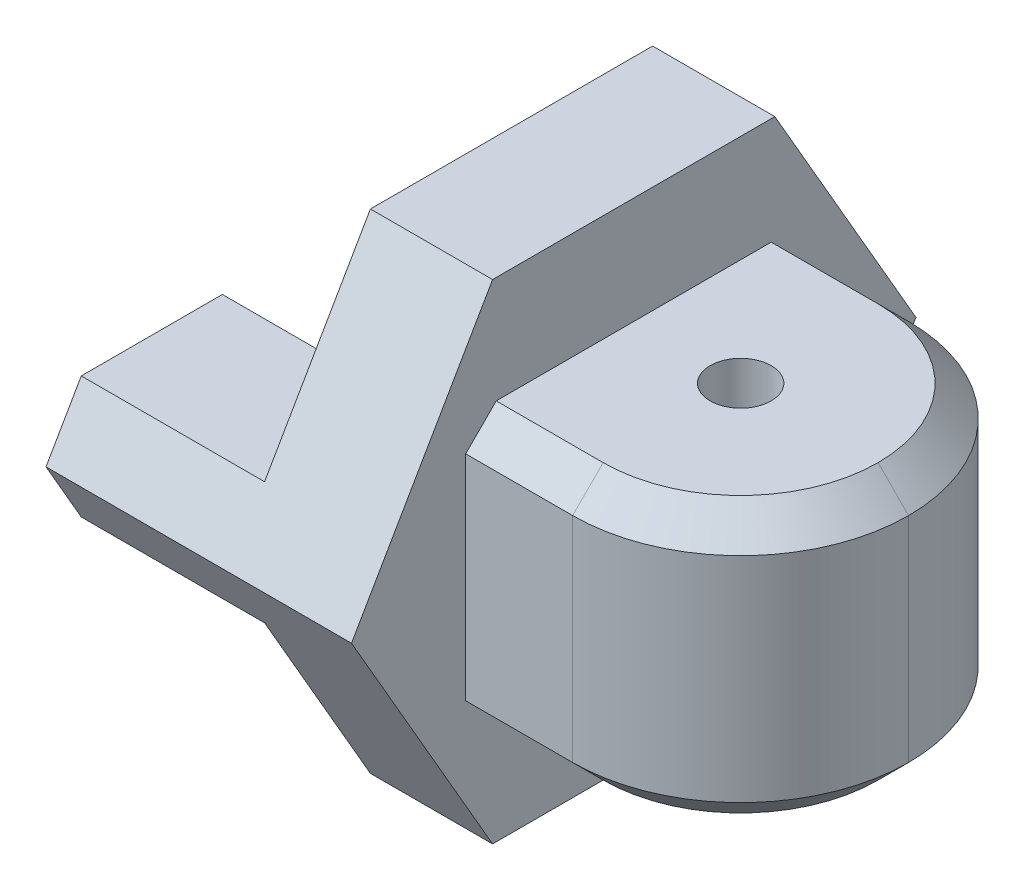
ISO-10303-21;
HEADER;
FILE_DESCRIPTION(('STEP AP214'),'2;1');
FILE_NAME('part.step','',(''),(''),'','','');
FILE_SCHEMA(('AUTOMOTIVE_DESIGN { 1 0 10303 214 1 1 1 1 }'));
ENDSEC;
DATA;
#1=APPLICATION_CONTEXT('core data for automotive mechanical design processes');
#2=APPLICATION_PROTOCOL_DEFINITION('international standard','automotive_design',2000,#1);
#3=PRODUCT_CONTEXT('',#1,'mechanical');
#4=PRODUCT('Part','Part','',(#3));
#5=PRODUCT_RELATED_PRODUCT_CATEGORY('part','',(#4));
#6=PRODUCT_DEFINITION_FORMATION('','',#4);
#7=PRODUCT_DEFINITION_CONTEXT('part definition',#1,'design');
#8=PRODUCT_DEFINITION('design','',#6,#7);
#9=PRODUCT_DEFINITION_SHAPE('','',#8);
#10=(LENGTH_UNIT() NAMED_UNIT(*) SI_UNIT(.MILLI.,.METRE.));
#11=(NAMED_UNIT(*) PLANE_ANGLE_UNIT() SI_UNIT($,.RADIAN.));
#12=(NAMED_UNIT(*) SI_UNIT($,.STERADIAN.) SOLID_ANGLE_UNIT());
#13=UNCERTAINTY_MEASURE_WITH_UNIT(LENGTH_MEASURE(1.E-05),#10,'distance_accuracy_value','');
#14=(GEOMETRIC_REPRESENTATION_CONTEXT(3) GLOBAL_UNCERTAINTY_ASSIGNED_CONTEXT((#13)) GLOBAL_UNIT_ASSIGNED_CONTEXT((#10,
#11,#12)) REPRESENTATION_CONTEXT('',''));
#15=CARTESIAN_POINT('',(0.,0.,0.));
#16=DIRECTION('',(0.,0.,1.));
#17=DIRECTION('',(1.,0.,0.));
#18=AXIS2_PLACEMENT_3D('',#15,#16,#17);
#19=CARTESIAN_POINT('',(50.,0.,0.));
#20=DIRECTION('',(1.,0.,0.));
#21=DIRECTION('',(0.,0.,-1.));
#22=AXIS2_PLACEMENT_3D('',#19,#20,#21);
#23=PLANE('',#22);
#24=DIRECTION('',(0.,0.866025403784439,-0.5));
#25=VECTOR('',#24,1.);
#26=CARTESIAN_POINT('',(50.,-40.,-23.0940107675851));
#27=LINE('',#26,#25);
#28=CARTESIAN_POINT('',(50.,-40.,-23.0940107675851));
#29=VERTEX_POINT('',#28);
#30=CARTESIAN_POINT('',(50.,0.,-46.1880215351701));
#31=VERTEX_POINT('',#30);
#32=EDGE_CURVE('E271',#29,#31,#27,.T.);
#33=ORIENTED_EDGE('',*,*,#32,.T.);
#34=DIRECTION('',(0.,0.866025403784438,0.5));
#35=VECTOR('',#34,1.);
#36=CARTESIAN_POINT('',(50.,0.,-46.1880215351701));
#37=LINE('',#36,#35);
#38=CARTESIAN_POINT('',(50.,40.,-23.094010767585));
#39=VERTEX_POINT('',#38);
#40=EDGE_CURVE('E274',#31,#39,#37,.T.);
#41=ORIENTED_EDGE('',*,*,#40,.T.);
#42=DIRECTION('',(0.,0.,1.));
#43=VECTOR('',#42,1.);
#44=CARTESIAN_POINT('',(50.,40.,-23.094010767585));
#45=LINE('',#44,#43);
#46=CARTESIAN_POINT('',(50.,40.,23.0940107675851));
#47=VERTEX_POINT('',#46);
#48=EDGE_CURVE('E277',#39,#47,#45,.T.);
#49=ORIENTED_EDGE('',*,*,#48,.T.);
#50=DIRECTION('',(0.,-0.866025403784439,0.5));
#51=VECTOR('',#50,1.);
#52=CARTESIAN_POINT('',(50.,40.,23.0940107675851));
#53=LINE('',#52,#51);
#54=CARTESIAN_POINT('',(50.,0.,46.1880215351701));
#55=VERTEX_POINT('',#54);
#56=EDGE_CURVE('E279',#47,#55,#53,.T.);
#57=ORIENTED_EDGE('',*,*,#56,.T.);
#58=DIRECTION('',(0.,-0.866025403784439,-0.5));
#59=VECTOR('',#58,1.);
#60=CARTESIAN_POINT('',(50.,0.,46.1880215351701));
#61=LINE('',#60,#59);
#62=CARTESIAN_POINT('',(50.,-40.,23.094010767585));
#63=VERTEX_POINT('',#62);
#64=EDGE_CURVE('E281',#55,#63,#61,.T.);
#65=ORIENTED_EDGE('',*,*,#64,.T.);
#66=DIRECTION('',(0.,0.,-1.));
#67=VECTOR('',#66,1.);
#68=CARTESIAN_POINT('',(50.,-40.,23.094010767585));
#69=LINE('',#68,#67);
#70=EDGE_CURVE('E283',#63,#29,#69,.T.);
#71=ORIENTED_EDGE('',*,*,#70,.T.);
#72=EDGE_LOOP('',(#33,#41,#49,#57,#65,#71));
#73=FACE_BOUND('',#72,.T.);
#74=DIRECTION('',(0.,1.,0.));
#75=VECTOR('',#74,1.);
#76=CARTESIAN_POINT('',(50.,-22.5,-27.5));
#77=LINE('',#76,#75);
#78=CARTESIAN_POINT('',(50.,-17.5,-27.5));
#79=VERTEX_POINT('',#78);
#80=CARTESIAN_POINT('',(50.,17.5,-27.5));
#81=VERTEX_POINT('',#80);
#82=EDGE_CURVE('E390',#79,#81,#77,.T.);
#83=ORIENTED_EDGE('',*,*,#82,.F.);
#84=DIRECTION('',(0.,0.707106781186546,-0.707106781186549));
#85=VECTOR('',#84,1.);
#86=CARTESIAN_POINT('',(50.,-17.5,-27.5));
#87=LINE('',#86,#85);
#88=CARTESIAN_POINT('',(50.,-22.5,-22.5));
#89=VERTEX_POINT('',#88);
#90=EDGE_CURVE('E337',#79,#89,#87,.F.);
#91=ORIENTED_EDGE('',*,*,#90,.T.);
#92=DIRECTION('',(0.,0.,-1.));
#93=VECTOR('',#92,1.);
#94=CARTESIAN_POINT('',(50.,-22.5,27.5));
#95=LINE('',#94,#93);
#96=CARTESIAN_POINT('',(50.,-22.5,22.5));
#97=VERTEX_POINT('',#96);
#98=EDGE_CURVE('E350',#97,#89,#95,.T.);
#99=ORIENTED_EDGE('',*,*,#98,.F.);
#100=DIRECTION('',(0.,0.707106781186546,0.707106781186549));
#101=VECTOR('',#100,1.);
#102=CARTESIAN_POINT('',(50.,-22.5,22.5));
#103=LINE('',#102,#101);
#104=CARTESIAN_POINT('',(50.,-17.5,27.5));
#105=VERTEX_POINT('',#104);
#106=EDGE_CURVE('E335',#97,#105,#103,.T.);
#107=ORIENTED_EDGE('',*,*,#106,.T.);
#108=DIRECTION('',(0.,1.,0.));
#109=VECTOR('',#108,1.);
#110=CARTESIAN_POINT('',(50.,-22.5,27.5));
#111=LINE('',#110,#109);
#112=CARTESIAN_POINT('',(50.,17.5,27.5));
#113=VERTEX_POINT('',#112);
#114=EDGE_CURVE('E394',#105,#113,#111,.T.);
#115=ORIENTED_EDGE('',*,*,#114,.T.);
#116=DIRECTION('',(0.,-0.707106781186551,0.707106781186544));
#117=VECTOR('',#116,1.);
#118=CARTESIAN_POINT('',(50.,17.5,27.5));
#119=LINE('',#118,#117);
#120=CARTESIAN_POINT('',(50.,22.5,22.5));
#121=VERTEX_POINT('',#120);
#122=EDGE_CURVE('E42',#113,#121,#119,.F.);
#123=ORIENTED_EDGE('',*,*,#122,.T.);
#124=DIRECTION('',(0.,0.,-1.));
#125=VECTOR('',#124,1.);
#126=CARTESIAN_POINT('',(50.,22.5,27.5));
#127=LINE('',#126,#125);
#128=CARTESIAN_POINT('',(50.,22.5,-22.5));
#129=VERTEX_POINT('',#128);
#130=EDGE_CURVE('E392',#121,#129,#127,.T.);
#131=ORIENTED_EDGE('',*,*,#130,.T.);
#132=DIRECTION('',(0.,-0.707106781186551,-0.707106781186544));
#133=VECTOR('',#132,1.);
#134=CARTESIAN_POINT('',(50.,22.5,-22.5));
#135=LINE('',#134,#133);
#136=EDGE_CURVE('E11',#129,#81,#135,.T.);
#137=ORIENTED_EDGE('',*,*,#136,.T.);
#138=EDGE_LOOP('',(#83,#91,#99,#107,#115,#123,#131,#137));
#139=FACE_BOUND('',#138,.T.);
#140=ADVANCED_FACE('F33',(#73,#139),#23,.T.);
#141=CARTESIAN_POINT('',(0.,0.,0.));
#142=DIRECTION('',(1.,0.,0.));
#143=DIRECTION('',(0.,0.,-1.));
#144=AXIS2_PLACEMENT_3D('',#141,#142,#143);
#145=PLANE('',#144);
#146=DIRECTION('',(0.,0.,1.));
#147=VECTOR('',#146,1.);
#148=CARTESIAN_POINT('',(0.,-9.99999999999999,0.));
#149=LINE('',#148,#147);
#150=CARTESIAN_POINT('',(0.,-9.99999999999999,-40.4145188432738));
#151=VERTEX_POINT('',#150);
#152=CARTESIAN_POINT('',(0.,-9.99999999999999,-17.3205080756888));
#153=VERTEX_POINT('',#152);
#154=EDGE_CURVE('E201',#151,#153,#149,.T.);
#155=ORIENTED_EDGE('',*,*,#154,.T.);
#156=CARTESIAN_POINT('',(0.,0.,0.));
#157=DIRECTION('',(1.,0.,0.));
#158=DIRECTION('',(0.,0.,-1.));
#159=AXIS2_PLACEMENT_3D('',#156,#157,#158);
#160=CIRCLE('',#159,20.);
#161=CARTESIAN_POINT('',(0.,10.,-17.3205080756888));
#162=VERTEX_POINT('',#161);
#163=EDGE_CURVE('E260',#153,#162,#160,.T.);
#164=ORIENTED_EDGE('',*,*,#163,.T.);
#165=DIRECTION('',(0.,0.,1.));
#166=VECTOR('',#165,1.);
#167=CARTESIAN_POINT('',(0.,10.,0.));
#168=LINE('',#167,#166);
#169=CARTESIAN_POINT('',(0.,10.,-40.4145188432738));
#170=VERTEX_POINT('',#169);
#171=EDGE_CURVE('E235',#170,#162,#168,.T.);
#172=ORIENTED_EDGE('',*,*,#171,.F.);
#173=DIRECTION('',(0.,0.866025403784438,0.5));
#174=VECTOR('',#173,1.);
#175=CARTESIAN_POINT('',(0.,0.,-46.1880215351701));
#176=LINE('',#175,#174);
#177=CARTESIAN_POINT('',(0.,0.,-46.1880215351701));
#178=VERTEX_POINT('',#177);
#179=EDGE_CURVE('E286',#178,#170,#176,.T.);
#180=ORIENTED_EDGE('',*,*,#179,.F.);
#181=DIRECTION('',(0.,0.866025403784439,-0.5));
#182=VECTOR('',#181,1.);
#183=CARTESIAN_POINT('',(0.,-40.,-23.0940107675851));
#184=LINE('',#183,#182);
#185=EDGE_CURVE('E270',#151,#178,#184,.T.);
#186=ORIENTED_EDGE('',*,*,#185,.F.);
#187=EDGE_LOOP('',(#155,#164,#172,#180,#186));
#188=FACE_BOUND('',#187,.T.);
#189=ADVANCED_FACE('F420',(#188),#145,.F.);
#190=CARTESIAN_POINT('',(0.,-9.99999999999999,17.3205080756888));
#191=VERTEX_POINT('',#190);
#192=CARTESIAN_POINT('',(0.,-9.99999999999999,40.4145188432738));
#193=VERTEX_POINT('',#192);
#194=EDGE_CURVE('E214',#191,#193,#149,.T.);
#195=ORIENTED_EDGE('',*,*,#194,.T.);
#196=DIRECTION('',(0.,-0.866025403784439,-0.5));
#197=VECTOR('',#196,1.);
#198=CARTESIAN_POINT('',(0.,0.,46.1880215351701));
#199=LINE('',#198,#197);
#200=CARTESIAN_POINT('',(0.,0.,46.1880215351701));
#201=VERTEX_POINT('',#200);
#202=EDGE_CURVE('E275',#201,#193,#199,.T.);
#203=ORIENTED_EDGE('',*,*,#202,.F.);
#204=DIRECTION('',(0.,-0.866025403784439,0.5));
#205=VECTOR('',#204,1.);
#206=CARTESIAN_POINT('',(0.,40.,23.0940107675851));
#207=LINE('',#206,#205);
#208=CARTESIAN_POINT('',(0.,10.,40.4145188432738));
#209=VERTEX_POINT('',#208);
#210=EDGE_CURVE('E289',#209,#201,#207,.T.);
#211=ORIENTED_EDGE('',*,*,#210,.F.);
#212=CARTESIAN_POINT('',(0.,10.,17.3205080756888));
#213=VERTEX_POINT('',#212);
#214=EDGE_CURVE('E244',#213,#209,#168,.T.);
#215=ORIENTED_EDGE('',*,*,#214,.F.);
#216=EDGE_CURVE('E267',#213,#191,#160,.T.);
#217=ORIENTED_EDGE('',*,*,#216,.T.);
#218=EDGE_LOOP('',(#195,#203,#211,#215,#217));
#219=FACE_BOUND('',#218,.T.);
#220=ADVANCED_FACE('F426',(#219),#145,.F.);
#221=CARTESIAN_POINT('',(50.,-40.,-23.0940107675851));
#222=DIRECTION('',(0.,0.5,0.866025403784439));
#223=DIRECTION('',(0.,-0.866025403784439,0.5));
#224=AXIS2_PLACEMENT_3D('',#221,#222,#223);
#225=PLANE('',#224);
#226=DIRECTION('',(-1.,0.,0.));
#227=VECTOR('',#226,1.);
#228=CARTESIAN_POINT('',(30.,-9.99999999999999,-40.4145188432738));
#229=LINE('',#228,#227);
#230=CARTESIAN_POINT('',(30.,-9.99999999999999,-40.4145188432738));
#231=VERTEX_POINT('',#230);
#232=EDGE_CURVE('E195',#231,#151,#229,.T.);
#233=ORIENTED_EDGE('',*,*,#232,.T.);
#234=ORIENTED_EDGE('',*,*,#185,.T.);
#235=DIRECTION('',(-1.,0.,0.));
#236=VECTOR('',#235,1.);
#237=CARTESIAN_POINT('',(50.,0.,-46.1880215351701));
#238=LINE('',#237,#236);
#239=EDGE_CURVE('E306',#31,#178,#238,.T.);
#240=ORIENTED_EDGE('',*,*,#239,.F.);
#241=ORIENTED_EDGE('',*,*,#32,.F.);
#242=DIRECTION('',(-1.,0.,0.));
#243=VECTOR('',#242,1.);
#244=CARTESIAN_POINT('',(50.,-40.,-23.0940107675851));
#245=LINE('',#244,#243);
#246=CARTESIAN_POINT('',(30.,-40.,-23.0940107675851));
#247=VERTEX_POINT('',#246);
#248=EDGE_CURVE('E221',#29,#247,#245,.T.);
#249=ORIENTED_EDGE('',*,*,#248,.T.);
#250=DIRECTION('',(0.,-0.866025403784439,0.5));
#251=VECTOR('',#250,1.);
#252=CARTESIAN_POINT('',(30.,-20.,-34.6410161513776));
#253=LINE('',#252,#251);
#254=EDGE_CURVE('E210',#231,#247,#253,.T.);
#255=ORIENTED_EDGE('',*,*,#254,.F.);
#256=EDGE_LOOP('',(#233,#234,#240,#241,#249,#255));
#257=FACE_BOUND('',#256,.T.);
#258=ADVANCED_FACE('F218',(#257),#225,.F.);
#259=CARTESIAN_POINT('',(50.,0.,46.1880215351701));
#260=DIRECTION('',(0.,0.5,-0.866025403784439));
#261=DIRECTION('',(0.,0.866025403784439,0.5));
#262=AXIS2_PLACEMENT_3D('',#259,#260,#261);
#263=PLANE('',#262);
#264=DIRECTION('',(-1.,0.,0.));
#265=VECTOR('',#264,1.);
#266=CARTESIAN_POINT('',(30.,-9.99999999999999,40.4145188432738));
#267=LINE('',#266,#265);
#268=CARTESIAN_POINT('',(30.,-9.99999999999999,40.4145188432738));
#269=VERTEX_POINT('',#268);
#270=EDGE_CURVE('E205',#269,#193,#267,.T.);
#271=ORIENTED_EDGE('',*,*,#270,.F.);
#272=DIRECTION('',(0.,0.866025403784439,0.5));
#273=VECTOR('',#272,1.);
#274=CARTESIAN_POINT('',(30.,-20.,34.6410161513776));
#275=LINE('',#274,#273);
#276=CARTESIAN_POINT('',(30.,-40.,23.094010767585));
#277=VERTEX_POINT('',#276);
#278=EDGE_CURVE('E224',#277,#269,#275,.T.);
#279=ORIENTED_EDGE('',*,*,#278,.F.);
#280=DIRECTION('',(-1.,0.,0.));
#281=VECTOR('',#280,1.);
#282=CARTESIAN_POINT('',(50.,-40.,23.094010767585));
#283=LINE('',#282,#281);
#284=EDGE_CURVE('E294',#63,#277,#283,.T.);
#285=ORIENTED_EDGE('',*,*,#284,.F.);
#286=ORIENTED_EDGE('',*,*,#64,.F.);
#287=DIRECTION('',(-1.,0.,0.));
#288=VECTOR('',#287,1.);
#289=CARTESIAN_POINT('',(50.,0.,46.1880215351701));
#290=LINE('',#289,#288);
#291=EDGE_CURVE('E297',#55,#201,#290,.T.);
#292=ORIENTED_EDGE('',*,*,#291,.T.);
#293=ORIENTED_EDGE('',*,*,#202,.T.);
#294=EDGE_LOOP('',(#271,#279,#285,#286,#292,#293));
#295=FACE_BOUND('',#294,.T.);
#296=ADVANCED_FACE('F435',(#295),#263,.F.);
#297=CARTESIAN_POINT('',(50.,-40.,23.094010767585));
#298=DIRECTION('',(0.,1.,0.));
#299=DIRECTION('',(0.,0.,1.));
#300=AXIS2_PLACEMENT_3D('',#297,#298,#299);
#301=PLANE('',#300);
#302=DIRECTION('',(0.,0.,1.));
#303=VECTOR('',#302,1.);
#304=CARTESIAN_POINT('',(30.,-40.,0.));
#305=LINE('',#304,#303);
#306=EDGE_CURVE('E222',#247,#277,#305,.T.);
#307=ORIENTED_EDGE('',*,*,#306,.F.);
#308=ORIENTED_EDGE('',*,*,#248,.F.);
#309=ORIENTED_EDGE('',*,*,#70,.F.);
#310=ORIENTED_EDGE('',*,*,#284,.T.);
#311=EDGE_LOOP('',(#307,#308,#309,#310));
#312=FACE_BOUND('',#311,.T.);
#313=ADVANCED_FACE('F432',(#312),#301,.F.);
#314=CARTESIAN_POINT('',(50.,0.,0.));
#315=DIRECTION('',(-1.,0.,0.));
#316=DIRECTION('',(0.,0.,1.));
#317=AXIS2_PLACEMENT_3D('',#314,#315,#316);
#318=CYLINDRICAL_SURFACE('',#317,20.);
#319=CARTESIAN_POINT('',(50.,0.,0.));
#320=DIRECTION('',(1.,0.,0.));
#321=DIRECTION('',(0.,0.,-1.));
#322=AXIS2_PLACEMENT_3D('',#319,#320,#321);
#323=CIRCLE('',#322,20.);
#324=CARTESIAN_POINT('',(50.,0.,-20.));
#325=VERTEX_POINT('',#324);
#326=EDGE_CURVE('E232',#325,#325,#323,.T.);
#327=ORIENTED_EDGE('',*,*,#326,.T.);
#328=EDGE_LOOP('',(#327));
#329=FACE_BOUND('',#328,.T.);
#330=ORIENTED_EDGE('',*,*,#163,.F.);
#331=DIRECTION('',(-1.,0.,0.));
#332=VECTOR('',#331,1.);
#333=CARTESIAN_POINT('',(30.,-9.99999999999999,-17.3205080756888));
#334=LINE('',#333,#332);
#335=CARTESIAN_POINT('',(30.,-9.99999999999999,-17.3205080756888));
#336=VERTEX_POINT('',#335);
#337=EDGE_CURVE('E233',#336,#153,#334,.T.);
#338=ORIENTED_EDGE('',*,*,#337,.F.);
#339=CARTESIAN_POINT('',(30.,0.,0.));
#340=DIRECTION('',(-1.,0.,0.));
#341=DIRECTION('',(0.,0.,1.));
#342=AXIS2_PLACEMENT_3D('',#339,#340,#341);
#343=CIRCLE('',#342,20.);
#344=CARTESIAN_POINT('',(30.,-9.99999999999999,17.3205080756888));
#345=VERTEX_POINT('',#344);
#346=EDGE_CURVE('E206',#345,#336,#343,.F.);
#347=ORIENTED_EDGE('',*,*,#346,.F.);
#348=DIRECTION('',(-1.,0.,0.));
#349=VECTOR('',#348,1.);
#350=CARTESIAN_POINT('',(30.,-9.99999999999999,17.3205080756888));
#351=LINE('',#350,#349);
#352=EDGE_CURVE('E236',#345,#191,#351,.T.);
#353=ORIENTED_EDGE('',*,*,#352,.T.);
#354=ORIENTED_EDGE('',*,*,#216,.F.);
#355=DIRECTION('',(-1.,0.,0.));
#356=VECTOR('',#355,1.);
#357=CARTESIAN_POINT('',(30.,10.,17.3205080756888));
#358=LINE('',#357,#356);
#359=CARTESIAN_POINT('',(30.,10.,17.3205080756888));
#360=VERTEX_POINT('',#359);
#361=EDGE_CURVE('E261',#360,#213,#358,.T.);
#362=ORIENTED_EDGE('',*,*,#361,.F.);
#363=CARTESIAN_POINT('',(30.,0.,0.));
#364=DIRECTION('',(-1.,0.,0.));
#365=DIRECTION('',(0.,0.,1.));
#366=AXIS2_PLACEMENT_3D('',#363,#364,#365);
#367=CIRCLE('',#366,20.);
#368=CARTESIAN_POINT('',(30.,10.,-17.3205080756888));
#369=VERTEX_POINT('',#368);
#370=EDGE_CURVE('E246',#369,#360,#367,.F.);
#371=ORIENTED_EDGE('',*,*,#370,.F.);
#372=DIRECTION('',(-1.,0.,0.));
#373=VECTOR('',#372,1.);
#374=CARTESIAN_POINT('',(30.,10.,-17.3205080756888));
#375=LINE('',#374,#373);
#376=EDGE_CURVE('E263',#369,#162,#375,.T.);
#377=ORIENTED_EDGE('',*,*,#376,.T.);
#378=EDGE_LOOP('',(#330,#338,#347,#353,#354,#362,#371,#377));
#379=FACE_BOUND('',#378,.T.);
#380=ADVANCED_FACE('F399',(#329,#379),#318,.F.);
#381=CARTESIAN_POINT('',(50.,40.,-23.094010767585));
#382=DIRECTION('',(0.,-1.,0.));
#383=DIRECTION('',(0.,0.,-1.));
#384=AXIS2_PLACEMENT_3D('',#381,#382,#383);
#385=PLANE('',#384);
#386=DIRECTION('',(0.,0.,-1.));
#387=VECTOR('',#386,1.);
#388=CARTESIAN_POINT('',(30.,40.,0.));
#389=LINE('',#388,#387);
#390=CARTESIAN_POINT('',(30.,40.,23.0940107675851));
#391=VERTEX_POINT('',#390);
#392=CARTESIAN_POINT('',(30.,40.,-23.094010767585));
#393=VERTEX_POINT('',#392);
#394=EDGE_CURVE('E252',#391,#393,#389,.T.);
#395=ORIENTED_EDGE('',*,*,#394,.F.);
#396=DIRECTION('',(-1.,0.,0.));
#397=VECTOR('',#396,1.);
#398=CARTESIAN_POINT('',(50.,40.,23.0940107675851));
#399=LINE('',#398,#397);
#400=EDGE_CURVE('E300',#47,#391,#399,.T.);
#401=ORIENTED_EDGE('',*,*,#400,.F.);
#402=ORIENTED_EDGE('',*,*,#48,.F.);
#403=DIRECTION('',(-1.,0.,0.));
#404=VECTOR('',#403,1.);
#405=CARTESIAN_POINT('',(50.,40.,-23.094010767585));
#406=LINE('',#405,#404);
#407=EDGE_CURVE('E303',#39,#393,#406,.T.);
#408=ORIENTED_EDGE('',*,*,#407,.T.);
#409=EDGE_LOOP('',(#395,#401,#402,#408));
#410=FACE_BOUND('',#409,.T.);
#411=ADVANCED_FACE('F446',(#410),#385,.F.);
#412=CARTESIAN_POINT('',(50.,0.,-46.1880215351701));
#413=DIRECTION('',(0.,-0.5,0.866025403784438));
#414=DIRECTION('',(0.,-0.866025403784439,-0.5));
#415=AXIS2_PLACEMENT_3D('',#412,#413,#414);
#416=PLANE('',#415);
#417=ORIENTED_EDGE('',*,*,#179,.T.);
#418=DIRECTION('',(-1.,0.,0.));
#419=VECTOR('',#418,1.);
#420=CARTESIAN_POINT('',(30.,10.,-40.4145188432738));
#421=LINE('',#420,#419);
#422=CARTESIAN_POINT('',(30.,10.,-40.4145188432738));
#423=VERTEX_POINT('',#422);
#424=EDGE_CURVE('E254',#423,#170,#421,.T.);
#425=ORIENTED_EDGE('',*,*,#424,.F.);
#426=DIRECTION('',(0.,-0.866025403784439,-0.5));
#427=VECTOR('',#426,1.);
#428=CARTESIAN_POINT('',(30.,20.,-34.6410161513776));
#429=LINE('',#428,#427);
#430=EDGE_CURVE('E240',#393,#423,#429,.T.);
#431=ORIENTED_EDGE('',*,*,#430,.F.);
#432=ORIENTED_EDGE('',*,*,#407,.F.);
#433=ORIENTED_EDGE('',*,*,#40,.F.);
#434=ORIENTED_EDGE('',*,*,#239,.T.);
#435=EDGE_LOOP('',(#417,#425,#431,#432,#433,#434));
#436=FACE_BOUND('',#435,.T.);
#437=ADVANCED_FACE('F444',(#436),#416,.F.);
#438=CARTESIAN_POINT('',(50.,40.,23.0940107675851));
#439=DIRECTION('',(0.,-0.5,-0.866025403784439));
#440=DIRECTION('',(0.,0.866025403784439,-0.5));
#441=AXIS2_PLACEMENT_3D('',#438,#439,#440);
#442=PLANE('',#441);
#443=DIRECTION('',(0.,0.866025403784439,-0.5));
#444=VECTOR('',#443,1.);
#445=CARTESIAN_POINT('',(30.,20.,34.6410161513776));
#446=LINE('',#445,#444);
#447=CARTESIAN_POINT('',(30.,10.,40.4145188432738));
#448=VERTEX_POINT('',#447);
#449=EDGE_CURVE('E250',#448,#391,#446,.T.);
#450=ORIENTED_EDGE('',*,*,#449,.F.);
#451=DIRECTION('',(-1.,0.,0.));
#452=VECTOR('',#451,1.);
#453=CARTESIAN_POINT('',(30.,10.,40.4145188432738));
#454=LINE('',#453,#452);
#455=EDGE_CURVE('E257',#448,#209,#454,.T.);
#456=ORIENTED_EDGE('',*,*,#455,.T.);
#457=ORIENTED_EDGE('',*,*,#210,.T.);
#458=ORIENTED_EDGE('',*,*,#291,.F.);
#459=ORIENTED_EDGE('',*,*,#56,.F.);
#460=ORIENTED_EDGE('',*,*,#400,.T.);
#461=EDGE_LOOP('',(#450,#456,#457,#458,#459,#460));
#462=FACE_BOUND('',#461,.T.);
#463=ADVANCED_FACE('F440',(#462),#442,.F.);
#464=CARTESIAN_POINT('',(30.,10.,0.));
#465=DIRECTION('',(0.,-1.,0.));
#466=DIRECTION('',(0.,0.,-1.));
#467=AXIS2_PLACEMENT_3D('',#464,#465,#466);
#468=PLANE('',#467);
#469=ORIENTED_EDGE('',*,*,#214,.T.);
#470=ORIENTED_EDGE('',*,*,#455,.F.);
#471=DIRECTION('',(0.,0.,1.));
#472=VECTOR('',#471,1.);
#473=CARTESIAN_POINT('',(30.,10.,0.));
#474=LINE('',#473,#472);
#475=EDGE_CURVE('E247',#360,#448,#474,.T.);
#476=ORIENTED_EDGE('',*,*,#475,.F.);
#477=ORIENTED_EDGE('',*,*,#361,.T.);
#478=EDGE_LOOP('',(#469,#470,#476,#477));
#479=FACE_BOUND('',#478,.T.);
#480=ADVANCED_FACE('F443',(#479),#468,.F.);
#481=ORIENTED_EDGE('',*,*,#171,.T.);
#482=ORIENTED_EDGE('',*,*,#376,.F.);
#483=EDGE_CURVE('E243',#423,#369,#474,.T.);
#484=ORIENTED_EDGE('',*,*,#483,.F.);
#485=ORIENTED_EDGE('',*,*,#424,.T.);
#486=EDGE_LOOP('',(#481,#482,#484,#485));
#487=FACE_BOUND('',#486,.T.);
#488=ADVANCED_FACE('F527',(#487),#468,.F.);
#489=CARTESIAN_POINT('',(30.,0.,0.));
#490=DIRECTION('',(-1.,0.,0.));
#491=DIRECTION('',(0.,0.,1.));
#492=AXIS2_PLACEMENT_3D('',#489,#490,#491);
#493=PLANE('',#492);
#494=ORIENTED_EDGE('',*,*,#430,.T.);
#495=ORIENTED_EDGE('',*,*,#483,.T.);
#496=ORIENTED_EDGE('',*,*,#370,.T.);
#497=ORIENTED_EDGE('',*,*,#475,.T.);
#498=ORIENTED_EDGE('',*,*,#449,.T.);
#499=ORIENTED_EDGE('',*,*,#394,.T.);
#500=EDGE_LOOP('',(#494,#495,#496,#497,#498,#499));
#501=FACE_BOUND('',#500,.T.);
#502=ADVANCED_FACE('F525',(#501),#493,.T.);
#503=CARTESIAN_POINT('',(30.,-9.99999999999999,0.));
#504=DIRECTION('',(0.,-1.,0.));
#505=DIRECTION('',(0.,0.,-1.));
#506=AXIS2_PLACEMENT_3D('',#503,#504,#505);
#507=PLANE('',#506);
#508=ORIENTED_EDGE('',*,*,#154,.F.);
#509=ORIENTED_EDGE('',*,*,#232,.F.);
#510=DIRECTION('',(0.,0.,1.));
#511=VECTOR('',#510,1.);
#512=CARTESIAN_POINT('',(30.,-9.99999999999999,0.));
#513=LINE('',#512,#511);
#514=EDGE_CURVE('E198',#231,#336,#513,.T.);
#515=ORIENTED_EDGE('',*,*,#514,.T.);
#516=ORIENTED_EDGE('',*,*,#337,.T.);
#517=EDGE_LOOP('',(#508,#509,#515,#516));
#518=FACE_BOUND('',#517,.T.);
#519=ADVANCED_FACE('F197',(#518),#507,.T.);
#520=ORIENTED_EDGE('',*,*,#194,.F.);
#521=ORIENTED_EDGE('',*,*,#352,.F.);
#522=EDGE_CURVE('E216',#345,#269,#513,.T.);
#523=ORIENTED_EDGE('',*,*,#522,.T.);
#524=ORIENTED_EDGE('',*,*,#270,.T.);
#525=EDGE_LOOP('',(#520,#521,#523,#524));
#526=FACE_BOUND('',#525,.T.);
#527=ADVANCED_FACE('F521',(#526),#507,.T.);
#528=CARTESIAN_POINT('',(30.,0.,0.));
#529=DIRECTION('',(-1.,0.,0.));
#530=DIRECTION('',(0.,0.,1.));
#531=AXIS2_PLACEMENT_3D('',#528,#529,#530);
#532=PLANE('',#531);
#533=ORIENTED_EDGE('',*,*,#514,.F.);
#534=ORIENTED_EDGE('',*,*,#254,.T.);
#535=ORIENTED_EDGE('',*,*,#306,.T.);
#536=ORIENTED_EDGE('',*,*,#278,.T.);
#537=ORIENTED_EDGE('',*,*,#522,.F.);
#538=ORIENTED_EDGE('',*,*,#346,.T.);
#539=EDGE_LOOP('',(#533,#534,#535,#536,#537,#538));
#540=FACE_BOUND('',#539,.T.);
#541=ADVANCED_FACE('F209',(#540),#532,.T.);
#542=CARTESIAN_POINT('',(95.,-22.5,27.5));
#543=DIRECTION('',(0.,0.,1.));
#544=DIRECTION('',(1.,0.,0.));
#545=AXIS2_PLACEMENT_3D('',#542,#543,#544);
#546=PLANE('',#545);
#547=DIRECTION('',(0.,1.,0.));
#548=VECTOR('',#547,1.);
#549=CARTESIAN_POINT('',(67.5,-22.5,27.5));
#550=LINE('',#549,#548);
#551=CARTESIAN_POINT('',(67.5,-17.5,27.5));
#552=VERTEX_POINT('',#551);
#553=CARTESIAN_POINT('',(67.5,17.5,27.5));
#554=VERTEX_POINT('',#553);
#555=EDGE_CURVE('E314',#552,#554,#550,.T.);
#556=ORIENTED_EDGE('',*,*,#555,.T.);
#557=DIRECTION('',(-1.,0.,0.));
#558=VECTOR('',#557,1.);
#559=CARTESIAN_POINT('',(95.,17.5,27.5));
#560=LINE('',#559,#558);
#561=EDGE_CURVE('E339',#554,#113,#560,.T.);
#562=ORIENTED_EDGE('',*,*,#561,.T.);
#563=ORIENTED_EDGE('',*,*,#114,.F.);
#564=DIRECTION('',(1.,0.,0.));
#565=VECTOR('',#564,1.);
#566=CARTESIAN_POINT('',(67.5,-17.5,27.5));
#567=LINE('',#566,#565);
#568=EDGE_CURVE('E326',#105,#552,#567,.T.);
#569=ORIENTED_EDGE('',*,*,#568,.T.);
#570=EDGE_LOOP('',(#556,#562,#563,#569));
#571=FACE_BOUND('',#570,.T.);
#572=ADVANCED_FACE('F515',(#571),#546,.T.);
#573=CARTESIAN_POINT('',(95.,22.5,27.5));
#574=DIRECTION('',(0.,1.,0.));
#575=DIRECTION('',(0.,0.,1.));
#576=AXIS2_PLACEMENT_3D('',#573,#574,#575);
#577=PLANE('',#576);
#578=ORIENTED_EDGE('',*,*,#130,.F.);
#579=DIRECTION('',(1.,0.,0.));
#580=VECTOR('',#579,1.);
#581=CARTESIAN_POINT('',(95.,22.5,22.5));
#582=LINE('',#581,#580);
#583=CARTESIAN_POINT('',(67.5,22.5,22.5));
#584=VERTEX_POINT('',#583);
#585=EDGE_CURVE('E359',#121,#584,#582,.T.);
#586=ORIENTED_EDGE('',*,*,#585,.T.);
#587=CARTESIAN_POINT('',(67.5,22.5,0.));
#588=DIRECTION('',(0.,1.,0.));
#589=DIRECTION('',(0.,0.,1.));
#590=AXIS2_PLACEMENT_3D('',#587,#588,#589);
#591=CIRCLE('',#590,22.5);
#592=CARTESIAN_POINT('',(90.,22.5,0.));
#593=VERTEX_POINT('',#592);
#594=EDGE_CURVE('E357',#584,#593,#591,.T.);
#595=ORIENTED_EDGE('',*,*,#594,.T.);
#596=CARTESIAN_POINT('',(67.5,22.5,0.));
#597=DIRECTION('',(0.,1.,0.));
#598=DIRECTION('',(0.,0.,1.));
#599=AXIS2_PLACEMENT_3D('',#596,#597,#598);
#600=CIRCLE('',#599,22.5);
#601=CARTESIAN_POINT('',(67.5,22.5,-22.5));
#602=VERTEX_POINT('',#601);
#603=EDGE_CURVE('E353',#593,#602,#600,.T.);
#604=ORIENTED_EDGE('',*,*,#603,.T.);
#605=DIRECTION('',(-1.,0.,0.));
#606=VECTOR('',#605,1.);
#607=CARTESIAN_POINT('',(50.,22.5,-22.5));
#608=LINE('',#607,#606);
#609=EDGE_CURVE('E355',#602,#129,#608,.T.);
#610=ORIENTED_EDGE('',*,*,#609,.T.);
#611=EDGE_LOOP('',(#578,#586,#595,#604,#610));
#612=FACE_BOUND('',#611,.T.);
#613=CARTESIAN_POINT('',(67.5000000000001,22.5,0.));
#614=DIRECTION('',(0.,1.,0.));
#615=DIRECTION('',(0.,0.,1.));
#616=AXIS2_PLACEMENT_3D('',#613,#614,#615);
#617=CIRCLE('',#616,5.);
#618=CARTESIAN_POINT('',(67.5000000000001,22.5,5.));
#619=VERTEX_POINT('',#618);
#620=EDGE_CURVE('E344',#619,#619,#617,.T.);
#621=ORIENTED_EDGE('',*,*,#620,.F.);
#622=EDGE_LOOP('',(#621));
#623=FACE_BOUND('',#622,.T.);
#624=ADVANCED_FACE('F510',(#612,#623),#577,.T.);
#625=CARTESIAN_POINT('',(95.,-22.5,-27.5));
#626=DIRECTION('',(0.,0.,1.));
#627=DIRECTION('',(1.,0.,0.));
#628=AXIS2_PLACEMENT_3D('',#625,#626,#627);
#629=PLANE('',#628);
#630=ORIENTED_EDGE('',*,*,#82,.T.);
#631=DIRECTION('',(1.,0.,0.));
#632=VECTOR('',#631,1.);
#633=CARTESIAN_POINT('',(67.5,17.5,-27.5));
#634=LINE('',#633,#632);
#635=CARTESIAN_POINT('',(67.5,17.5,-27.5));
#636=VERTEX_POINT('',#635);
#637=EDGE_CURVE('E55',#81,#636,#634,.T.);
#638=ORIENTED_EDGE('',*,*,#637,.T.);
#639=DIRECTION('',(0.,1.,0.));
#640=VECTOR('',#639,1.);
#641=CARTESIAN_POINT('',(67.5,-22.5,-27.5));
#642=LINE('',#641,#640);
#643=CARTESIAN_POINT('',(67.5,-17.5,-27.5));
#644=VERTEX_POINT('',#643);
#645=EDGE_CURVE('E312',#636,#644,#642,.F.);
#646=ORIENTED_EDGE('',*,*,#645,.T.);
#647=DIRECTION('',(-1.,0.,0.));
#648=VECTOR('',#647,1.);
#649=CARTESIAN_POINT('',(95.,-17.5,-27.5));
#650=LINE('',#649,#648);
#651=EDGE_CURVE('E333',#644,#79,#650,.T.);
#652=ORIENTED_EDGE('',*,*,#651,.T.);
#653=EDGE_LOOP('',(#630,#638,#646,#652));
#654=FACE_BOUND('',#653,.T.);
#655=ADVANCED_FACE('F414',(#654),#629,.F.);
#656=CARTESIAN_POINT('',(95.,-22.5,27.5));
#657=DIRECTION('',(0.,1.,0.));
#658=DIRECTION('',(0.,0.,1.));
#659=AXIS2_PLACEMENT_3D('',#656,#657,#658);
#660=PLANE('',#659);
#661=CARTESIAN_POINT('',(67.5000000000001,-22.5,0.));
#662=DIRECTION('',(0.,-1.,0.));
#663=DIRECTION('',(0.,0.,-1.));
#664=AXIS2_PLACEMENT_3D('',#661,#662,#663);
#665=CIRCLE('',#664,5.);
#666=CARTESIAN_POINT('',(67.5000000000001,-22.5,-5.));
#667=VERTEX_POINT('',#666);
#668=EDGE_CURVE('E376',#667,#667,#665,.T.);
#669=ORIENTED_EDGE('',*,*,#668,.F.);
#670=EDGE_LOOP('',(#669));
#671=FACE_BOUND('',#670,.T.);
#672=CARTESIAN_POINT('',(67.5,-22.5,0.));
#673=DIRECTION('',(0.,1.,0.));
#674=DIRECTION('',(0.,0.,1.));
#675=AXIS2_PLACEMENT_3D('',#672,#673,#674);
#676=CIRCLE('',#675,22.5);
#677=CARTESIAN_POINT('',(90.,-22.5,0.));
#678=VERTEX_POINT('',#677);
#679=CARTESIAN_POINT('',(67.5,-22.5,22.5));
#680=VERTEX_POINT('',#679);
#681=EDGE_CURVE('E321',#678,#680,#676,.F.);
#682=ORIENTED_EDGE('',*,*,#681,.T.);
#683=DIRECTION('',(-1.,0.,0.));
#684=VECTOR('',#683,1.);
#685=CARTESIAN_POINT('',(50.,-22.5,22.5));
#686=LINE('',#685,#684);
#687=EDGE_CURVE('E323',#680,#97,#686,.T.);
#688=ORIENTED_EDGE('',*,*,#687,.T.);
#689=ORIENTED_EDGE('',*,*,#98,.T.);
#690=DIRECTION('',(1.,0.,0.));
#691=VECTOR('',#690,1.);
#692=CARTESIAN_POINT('',(95.,-22.5,-22.5));
#693=LINE('',#692,#691);
#694=CARTESIAN_POINT('',(67.5,-22.5,-22.5));
#695=VERTEX_POINT('',#694);
#696=EDGE_CURVE('E317',#89,#695,#693,.T.);
#697=ORIENTED_EDGE('',*,*,#696,.T.);
#698=CARTESIAN_POINT('',(67.5,-22.5,0.));
#699=DIRECTION('',(0.,1.,0.));
#700=DIRECTION('',(0.,0.,1.));
#701=AXIS2_PLACEMENT_3D('',#698,#699,#700);
#702=CIRCLE('',#701,22.5);
#703=EDGE_CURVE('E319',#695,#678,#702,.F.);
#704=ORIENTED_EDGE('',*,*,#703,.T.);
#705=EDGE_LOOP('',(#682,#688,#689,#697,#704));
#706=FACE_BOUND('',#705,.T.);
#707=ADVANCED_FACE('F405',(#671,#706),#660,.F.);
#708=CARTESIAN_POINT('',(50.,0.,0.));
#709=DIRECTION('',(1.,0.,0.));
#710=DIRECTION('',(0.,0.,-1.));
#711=AXIS2_PLACEMENT_3D('',#708,#709,#710);
#712=PLANE('',#711);
#713=ORIENTED_EDGE('',*,*,#326,.F.);
#714=EDGE_LOOP('',(#713));
#715=FACE_BOUND('',#714,.T.);
#716=ADVANCED_FACE('F402',(#715),#712,.F.);
#717=CARTESIAN_POINT('',(67.5,0.,0.));
#718=DIRECTION('',(0.,-1.,0.));
#719=DIRECTION('',(0.,0.,-1.));
#720=AXIS2_PLACEMENT_3D('',#717,#718,#719);
#721=CYLINDRICAL_SURFACE('',#720,27.5);
#722=ORIENTED_EDGE('',*,*,#645,.F.);
#723=CARTESIAN_POINT('',(67.5,17.5,0.));
#724=DIRECTION('',(0.,1.,0.));
#725=DIRECTION('',(0.,0.,1.));
#726=AXIS2_PLACEMENT_3D('',#723,#724,#725);
#727=CIRCLE('',#726,27.5);
#728=CARTESIAN_POINT('',(95.,17.5,0.));
#729=VERTEX_POINT('',#728);
#730=EDGE_CURVE('E364',#636,#729,#727,.F.);
#731=ORIENTED_EDGE('',*,*,#730,.T.);
#732=DIRECTION('',(0.,1.,0.));
#733=VECTOR('',#732,1.);
#734=CARTESIAN_POINT('',(95.,22.5,0.));
#735=LINE('',#734,#733);
#736=CARTESIAN_POINT('',(95.,-17.5,0.));
#737=VERTEX_POINT('',#736);
#738=EDGE_CURVE('E309',#737,#729,#735,.T.);
#739=ORIENTED_EDGE('',*,*,#738,.F.);
#740=CARTESIAN_POINT('',(67.5,-17.5,0.));
#741=DIRECTION('',(0.,1.,0.));
#742=DIRECTION('',(0.,0.,1.));
#743=AXIS2_PLACEMENT_3D('',#740,#741,#742);
#744=CIRCLE('',#743,27.5);
#745=EDGE_CURVE('E330',#737,#644,#744,.T.);
#746=ORIENTED_EDGE('',*,*,#745,.T.);
#747=EDGE_LOOP('',(#722,#731,#739,#746));
#748=FACE_BOUND('',#747,.T.);
#749=ADVANCED_FACE('F404',(#748),#721,.T.);
#750=CARTESIAN_POINT('',(67.5,-22.5,0.));
#751=DIRECTION('',(0.,1.,0.));
#752=DIRECTION('',(0.,0.,1.));
#753=AXIS2_PLACEMENT_3D('',#750,#751,#752);
#754=CYLINDRICAL_SURFACE('',#753,27.5);
#755=ORIENTED_EDGE('',*,*,#738,.T.);
#756=CARTESIAN_POINT('',(67.5,17.5,0.));
#757=DIRECTION('',(0.,1.,0.));
#758=DIRECTION('',(0.,0.,1.));
#759=AXIS2_PLACEMENT_3D('',#756,#757,#758);
#760=CIRCLE('',#759,27.5);
#761=EDGE_CURVE('E361',#729,#554,#760,.F.);
#762=ORIENTED_EDGE('',*,*,#761,.T.);
#763=ORIENTED_EDGE('',*,*,#555,.F.);
#764=CARTESIAN_POINT('',(67.5,-17.5,0.));
#765=DIRECTION('',(0.,1.,0.));
#766=DIRECTION('',(0.,0.,1.));
#767=AXIS2_PLACEMENT_3D('',#764,#765,#766);
#768=CIRCLE('',#767,27.5);
#769=EDGE_CURVE('E328',#552,#737,#768,.T.);
#770=ORIENTED_EDGE('',*,*,#769,.T.);
#771=EDGE_LOOP('',(#755,#762,#763,#770));
#772=FACE_BOUND('',#771,.T.);
#773=ADVANCED_FACE('F411',(#772),#754,.T.);
#774=CARTESIAN_POINT('',(95.,-17.5,-27.5));
#775=DIRECTION('',(0.,0.707106781186549,0.707106781186546));
#776=DIRECTION('',(-1.,0.,0.));
#777=AXIS2_PLACEMENT_3D('',#774,#775,#776);
#778=PLANE('',#777);
#779=ORIENTED_EDGE('',*,*,#90,.F.);
#780=ORIENTED_EDGE('',*,*,#651,.F.);
#781=DIRECTION('',(0.,0.707106781186546,-0.707106781186549));
#782=VECTOR('',#781,1.);
#783=CARTESIAN_POINT('',(67.5,-22.5,-22.5));
#784=LINE('',#783,#782);
#785=EDGE_CURVE('E347',#695,#644,#784,.T.);
#786=ORIENTED_EDGE('',*,*,#785,.F.);
#787=ORIENTED_EDGE('',*,*,#696,.F.);
#788=EDGE_LOOP('',(#779,#780,#786,#787));
#789=FACE_BOUND('',#788,.T.);
#790=ADVANCED_FACE('F457',(#789),#778,.F.);
#791=CARTESIAN_POINT('',(67.5,-22.5,0.));
#792=DIRECTION('',(0.,1.,0.));
#793=DIRECTION('',(0.,0.,1.));
#794=AXIS2_PLACEMENT_3D('',#791,#792,#793);
#795=CONICAL_SURFACE('',#794,22.5,0.785398163397451);
#796=ORIENTED_EDGE('',*,*,#785,.T.);
#797=ORIENTED_EDGE('',*,*,#745,.F.);
#798=DIRECTION('',(0.707106781186549,0.707106781186545,0.));
#799=VECTOR('',#798,1.);
#800=CARTESIAN_POINT('',(90.,-22.5,0.));
#801=LINE('',#800,#799);
#802=EDGE_CURVE('E343',#678,#737,#801,.T.);
#803=ORIENTED_EDGE('',*,*,#802,.F.);
#804=ORIENTED_EDGE('',*,*,#703,.F.);
#805=EDGE_LOOP('',(#796,#797,#803,#804));
#806=FACE_BOUND('',#805,.T.);
#807=ADVANCED_FACE('F467',(#806),#795,.T.);
#808=CARTESIAN_POINT('',(67.5,-22.5,0.));
#809=DIRECTION('',(0.,1.,0.));
#810=DIRECTION('',(0.,0.,1.));
#811=AXIS2_PLACEMENT_3D('',#808,#809,#810);
#812=CONICAL_SURFACE('',#811,22.5,0.785398163397451);
#813=ORIENTED_EDGE('',*,*,#802,.T.);
#814=ORIENTED_EDGE('',*,*,#769,.F.);
#815=DIRECTION('',(0.,0.707106781186545,0.707106781186549));
#816=VECTOR('',#815,1.);
#817=CARTESIAN_POINT('',(67.5,-22.5,22.5));
#818=LINE('',#817,#816);
#819=EDGE_CURVE('E340',#680,#552,#818,.T.);
#820=ORIENTED_EDGE('',*,*,#819,.F.);
#821=ORIENTED_EDGE('',*,*,#681,.F.);
#822=EDGE_LOOP('',(#813,#814,#820,#821));
#823=FACE_BOUND('',#822,.T.);
#824=ADVANCED_FACE('F463',(#823),#812,.T.);
#825=CARTESIAN_POINT('',(95.,-22.5,22.5));
#826=DIRECTION('',(0.,-0.707106781186549,0.707106781186546));
#827=DIRECTION('',(1.,0.,0.));
#828=AXIS2_PLACEMENT_3D('',#825,#826,#827);
#829=PLANE('',#828);
#830=ORIENTED_EDGE('',*,*,#819,.T.);
#831=ORIENTED_EDGE('',*,*,#568,.F.);
#832=ORIENTED_EDGE('',*,*,#106,.F.);
#833=ORIENTED_EDGE('',*,*,#687,.F.);
#834=EDGE_LOOP('',(#830,#831,#832,#833));
#835=FACE_BOUND('',#834,.T.);
#836=ADVANCED_FACE('F459',(#835),#829,.T.);
#837=CARTESIAN_POINT('',(67.5000000000001,40.,0.));
#838=DIRECTION('',(0.,-1.,0.));
#839=DIRECTION('',(0.,0.,-1.));
#840=AXIS2_PLACEMENT_3D('',#837,#838,#839);
#841=CYLINDRICAL_SURFACE('',#840,5.);
#842=ORIENTED_EDGE('',*,*,#620,.T.);
#843=EDGE_LOOP('',(#842));
#844=FACE_BOUND('',#843,.T.);
#845=ORIENTED_EDGE('',*,*,#668,.T.);
#846=EDGE_LOOP('',(#845));
#847=FACE_BOUND('',#846,.T.);
#848=ADVANCED_FACE('F462',(#844,#847),#841,.F.);
#849=CARTESIAN_POINT('',(95.,22.5,-22.5));
#850=DIRECTION('',(0.,0.707106781186544,-0.707106781186551));
#851=DIRECTION('',(1.,0.,0.));
#852=AXIS2_PLACEMENT_3D('',#849,#850,#851);
#853=PLANE('',#852);
#854=ORIENTED_EDGE('',*,*,#136,.F.);
#855=ORIENTED_EDGE('',*,*,#609,.F.);
#856=DIRECTION('',(0.,0.707106781186551,0.707106781186544));
#857=VECTOR('',#856,1.);
#858=CARTESIAN_POINT('',(67.5,17.5,-27.5));
#859=LINE('',#858,#857);
#860=EDGE_CURVE('E37',#636,#602,#859,.T.);
#861=ORIENTED_EDGE('',*,*,#860,.F.);
#862=ORIENTED_EDGE('',*,*,#637,.F.);
#863=EDGE_LOOP('',(#854,#855,#861,#862));
#864=FACE_BOUND('',#863,.T.);
#865=ADVANCED_FACE('F35',(#864),#853,.T.);
#866=CARTESIAN_POINT('',(67.5,22.5,0.));
#867=DIRECTION('',(0.,-1.,0.));
#868=DIRECTION('',(0.,0.,-1.));
#869=AXIS2_PLACEMENT_3D('',#866,#867,#868);
#870=CONICAL_SURFACE('',#869,22.5,0.785398163397445);
#871=ORIENTED_EDGE('',*,*,#860,.T.);
#872=ORIENTED_EDGE('',*,*,#603,.F.);
#873=DIRECTION('',(-0.707106781186545,0.70710678118655,0.));
#874=VECTOR('',#873,1.);
#875=CARTESIAN_POINT('',(95.,17.5,0.));
#876=LINE('',#875,#874);
#877=EDGE_CURVE('E369',#729,#593,#876,.T.);
#878=ORIENTED_EDGE('',*,*,#877,.F.);
#879=ORIENTED_EDGE('',*,*,#730,.F.);
#880=EDGE_LOOP('',(#871,#872,#878,#879));
#881=FACE_BOUND('',#880,.T.);
#882=ADVANCED_FACE('F481',(#881),#870,.T.);
#883=CARTESIAN_POINT('',(67.5,22.5,0.));
#884=DIRECTION('',(0.,-1.,0.));
#885=DIRECTION('',(0.,0.,-1.));
#886=AXIS2_PLACEMENT_3D('',#883,#884,#885);
#887=CONICAL_SURFACE('',#886,22.5,0.785398163397445);
#888=ORIENTED_EDGE('',*,*,#877,.T.);
#889=ORIENTED_EDGE('',*,*,#594,.F.);
#890=DIRECTION('',(0.,0.70710678118655,-0.707106781186545));
#891=VECTOR('',#890,1.);
#892=CARTESIAN_POINT('',(67.5,17.5,27.5));
#893=LINE('',#892,#891);
#894=EDGE_CURVE('E367',#554,#584,#893,.T.);
#895=ORIENTED_EDGE('',*,*,#894,.F.);
#896=ORIENTED_EDGE('',*,*,#761,.F.);
#897=EDGE_LOOP('',(#888,#889,#895,#896));
#898=FACE_BOUND('',#897,.T.);
#899=ADVANCED_FACE('F478',(#898),#887,.T.);
#900=CARTESIAN_POINT('',(95.,17.5,27.5));
#901=DIRECTION('',(0.,-0.707106781186544,-0.707106781186551));
#902=DIRECTION('',(-1.,0.,0.));
#903=AXIS2_PLACEMENT_3D('',#900,#901,#902);
#904=PLANE('',#903);
#905=ORIENTED_EDGE('',*,*,#894,.T.);
#906=ORIENTED_EDGE('',*,*,#585,.F.);
#907=ORIENTED_EDGE('',*,*,#122,.F.);
#908=ORIENTED_EDGE('',*,*,#561,.F.);
#909=EDGE_LOOP('',(#905,#906,#907,#908));
#910=FACE_BOUND('',#909,.T.);
#911=ADVANCED_FACE('F475',(#910),#904,.F.);
#912=CLOSED_SHELL('',(#140,#189,#220,#258,#296,#313,#380,#411,#437,#463,#480,#488,#502,#519,
#527,#541,#572,#624,#655,#707,#716,#749,#773,#790,#807,#824,#836,#848,#865,#882,#899,#911));
#913=MANIFOLD_SOLID_BREP('B2',#912);
#914=ADVANCED_BREP_SHAPE_REPRESENTATION('',(#18,#913),#14);
#915=SHAPE_DEFINITION_REPRESENTATION(#9,#914);
ENDSEC;
END-ISO-10303-21;
